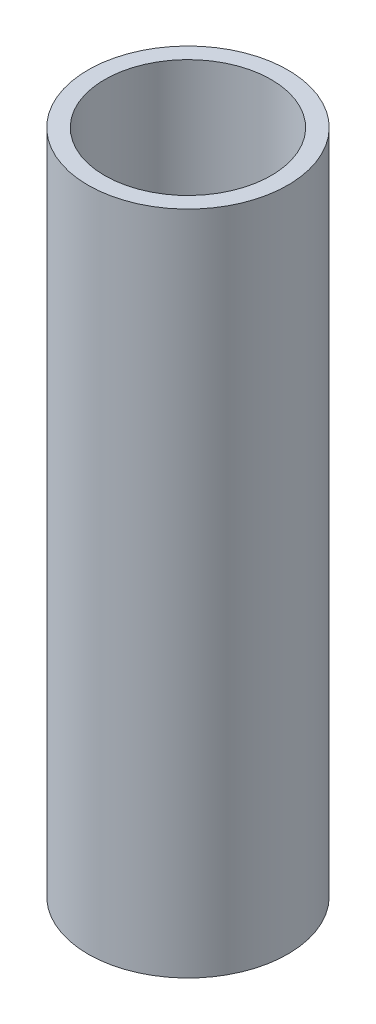
ISO-10303-21;
HEADER;
FILE_DESCRIPTION(('STEP AP214'),'2;1');
FILE_NAME('part.step','',(''),(''),'','','');
FILE_SCHEMA(('AUTOMOTIVE_DESIGN { 1 0 10303 214 1 1 1 1 }'));
ENDSEC;
DATA;
#1=APPLICATION_CONTEXT('core data for automotive mechanical design processes');
#2=APPLICATION_PROTOCOL_DEFINITION('international standard','automotive_design',2000,#1);
#3=PRODUCT_CONTEXT('',#1,'mechanical');
#4=PRODUCT('Part','Part','',(#3));
#5=PRODUCT_RELATED_PRODUCT_CATEGORY('part','',(#4));
#6=PRODUCT_DEFINITION_FORMATION('','',#4);
#7=PRODUCT_DEFINITION_CONTEXT('part definition',#1,'design');
#8=PRODUCT_DEFINITION('design','',#6,#7);
#9=PRODUCT_DEFINITION_SHAPE('','',#8);
#10=(LENGTH_UNIT() NAMED_UNIT(*) SI_UNIT(.MILLI.,.METRE.));
#11=(NAMED_UNIT(*) PLANE_ANGLE_UNIT() SI_UNIT($,.RADIAN.));
#12=(NAMED_UNIT(*) SI_UNIT($,.STERADIAN.) SOLID_ANGLE_UNIT());
#13=UNCERTAINTY_MEASURE_WITH_UNIT(LENGTH_MEASURE(1.E-05),#10,'distance_accuracy_value','');
#14=(GEOMETRIC_REPRESENTATION_CONTEXT(3) GLOBAL_UNCERTAINTY_ASSIGNED_CONTEXT((#13)) GLOBAL_UNIT_ASSIGNED_CONTEXT((#10,
#11,#12)) REPRESENTATION_CONTEXT('',''));
#15=CARTESIAN_POINT('',(0.,0.,0.));
#16=DIRECTION('',(0.,0.,1.));
#17=DIRECTION('',(1.,0.,0.));
#18=AXIS2_PLACEMENT_3D('',#15,#16,#17);
#19=CARTESIAN_POINT('',(0.,182.525,0.));
#20=DIRECTION('',(0.,1.,0.));
#21=DIRECTION('',(0.,0.,1.));
#22=AXIS2_PLACEMENT_3D('',#19,#20,#21);
#23=CYLINDRICAL_SURFACE('',#22,6.);
#24=CARTESIAN_POINT('',(0.,150.525,0.));
#25=DIRECTION('',(0.,1.,0.));
#26=DIRECTION('',(0.,0.,1.));
#27=AXIS2_PLACEMENT_3D('',#24,#25,#26);
#28=CIRCLE('',#27,6.);
#29=CARTESIAN_POINT('',(0.,150.525,6.));
#30=VERTEX_POINT('',#29);
#31=EDGE_CURVE('E10',#30,#30,#28,.T.);
#32=ORIENTED_EDGE('',*,*,#31,.T.);
#33=EDGE_LOOP('',(#32));
#34=FACE_BOUND('',#33,.T.);
#35=CARTESIAN_POINT('',(0.,190.525,0.));
#36=DIRECTION('',(0.,1.,0.));
#37=DIRECTION('',(0.,0.,1.));
#38=AXIS2_PLACEMENT_3D('',#35,#36,#37);
#39=CIRCLE('',#38,6.);
#40=CARTESIAN_POINT('',(0.,190.525,6.));
#41=VERTEX_POINT('',#40);
#42=EDGE_CURVE('E53',#41,#41,#39,.T.);
#43=ORIENTED_EDGE('',*,*,#42,.F.);
#44=EDGE_LOOP('',(#43));
#45=FACE_BOUND('',#44,.T.);
#46=ADVANCED_FACE('F39',(#34,#45),#23,.T.);
#47=CARTESIAN_POINT('',(0.,150.525,0.));
#48=DIRECTION('',(0.,-1.,0.));
#49=DIRECTION('',(0.,0.,-1.));
#50=AXIS2_PLACEMENT_3D('',#47,#48,#49);
#51=PLANE('',#50);
#52=CARTESIAN_POINT('',(0.,150.525,0.));
#53=DIRECTION('',(0.,1.,0.));
#54=DIRECTION('',(0.,0.,1.));
#55=AXIS2_PLACEMENT_3D('',#52,#53,#54);
#56=CIRCLE('',#55,5.);
#57=CARTESIAN_POINT('',(0.,150.525,5.));
#58=VERTEX_POINT('',#57);
#59=EDGE_CURVE('E45',#58,#58,#56,.T.);
#60=ORIENTED_EDGE('',*,*,#59,.T.);
#61=EDGE_LOOP('',(#60));
#62=FACE_BOUND('',#61,.T.);
#63=ORIENTED_EDGE('',*,*,#31,.F.);
#64=EDGE_LOOP('',(#63));
#65=FACE_BOUND('',#64,.T.);
#66=ADVANCED_FACE('F62',(#62,#65),#51,.T.);
#67=CARTESIAN_POINT('',(0.,182.525,0.));
#68=DIRECTION('',(0.,1.,0.));
#69=DIRECTION('',(0.,0.,1.));
#70=AXIS2_PLACEMENT_3D('',#67,#68,#69);
#71=CYLINDRICAL_SURFACE('',#70,5.);
#72=ORIENTED_EDGE('',*,*,#59,.F.);
#73=EDGE_LOOP('',(#72));
#74=FACE_BOUND('',#73,.T.);
#75=CARTESIAN_POINT('',(0.,190.525,0.));
#76=DIRECTION('',(0.,1.,0.));
#77=DIRECTION('',(0.,0.,1.));
#78=AXIS2_PLACEMENT_3D('',#75,#76,#77);
#79=CIRCLE('',#78,5.);
#80=CARTESIAN_POINT('',(0.,190.525,5.));
#81=VERTEX_POINT('',#80);
#82=EDGE_CURVE('E49',#81,#81,#79,.T.);
#83=ORIENTED_EDGE('',*,*,#82,.T.);
#84=EDGE_LOOP('',(#83));
#85=FACE_BOUND('',#84,.T.);
#86=ADVANCED_FACE('F66',(#74,#85),#71,.F.);
#87=CARTESIAN_POINT('',(0.,190.525,0.));
#88=DIRECTION('',(0.,-1.,0.));
#89=DIRECTION('',(0.,0.,-1.));
#90=AXIS2_PLACEMENT_3D('',#87,#88,#89);
#91=PLANE('',#90);
#92=ORIENTED_EDGE('',*,*,#82,.F.);
#93=EDGE_LOOP('',(#92));
#94=FACE_BOUND('',#93,.T.);
#95=ORIENTED_EDGE('',*,*,#42,.T.);
#96=EDGE_LOOP('',(#95));
#97=FACE_BOUND('',#96,.T.);
#98=ADVANCED_FACE('F59',(#94,#97),#91,.F.);
#99=CLOSED_SHELL('',(#46,#66,#86,#98));
#100=MANIFOLD_SOLID_BREP('B2',#99);
#101=ADVANCED_BREP_SHAPE_REPRESENTATION('',(#18,#100),#14);
#102=SHAPE_DEFINITION_REPRESENTATION(#9,#101);
ENDSEC;
END-ISO-10303-21;
